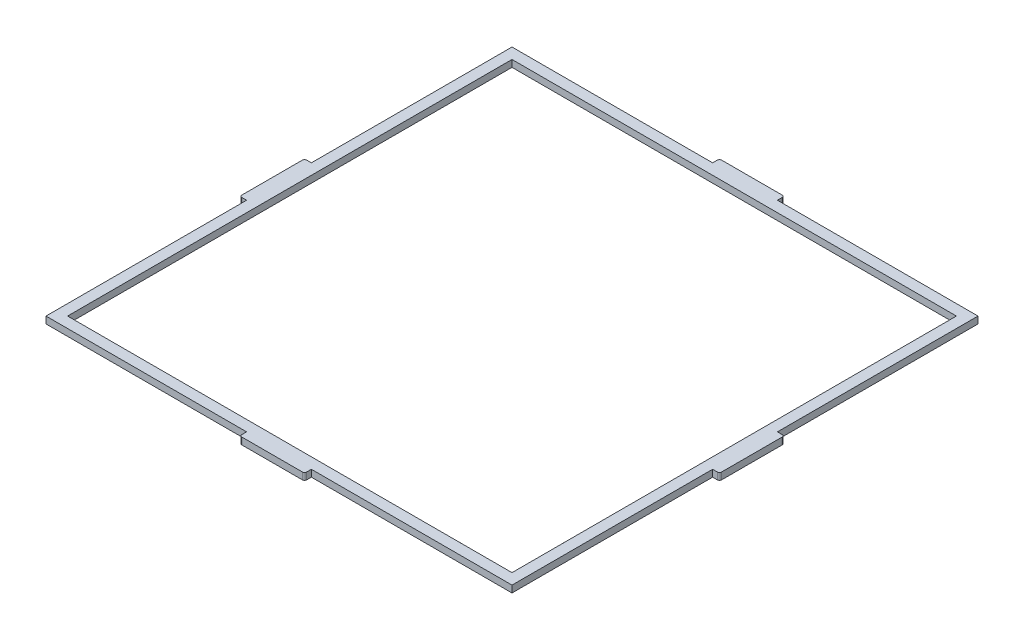
ISO-10303-21;
HEADER;
FILE_DESCRIPTION(('STEP AP214'),'2;1');
FILE_NAME('part.step','',(''),(''),'','','');
FILE_SCHEMA(('AUTOMOTIVE_DESIGN { 1 0 10303 214 1 1 1 1 }'));
ENDSEC;
DATA;
#1=APPLICATION_CONTEXT('core data for automotive mechanical design processes');
#2=APPLICATION_PROTOCOL_DEFINITION('international standard','automotive_design',2000,#1);
#3=PRODUCT_CONTEXT('',#1,'mechanical');
#4=PRODUCT('Part','Part','',(#3));
#5=PRODUCT_RELATED_PRODUCT_CATEGORY('part','',(#4));
#6=PRODUCT_DEFINITION_FORMATION('','',#4);
#7=PRODUCT_DEFINITION_CONTEXT('part definition',#1,'design');
#8=PRODUCT_DEFINITION('design','',#6,#7);
#9=PRODUCT_DEFINITION_SHAPE('','',#8);
#10=(LENGTH_UNIT() NAMED_UNIT(*) SI_UNIT(.MILLI.,.METRE.));
#11=(NAMED_UNIT(*) PLANE_ANGLE_UNIT() SI_UNIT($,.RADIAN.));
#12=(NAMED_UNIT(*) SI_UNIT($,.STERADIAN.) SOLID_ANGLE_UNIT());
#13=UNCERTAINTY_MEASURE_WITH_UNIT(LENGTH_MEASURE(1.E-05),#10,'distance_accuracy_value','');
#14=(GEOMETRIC_REPRESENTATION_CONTEXT(3) GLOBAL_UNCERTAINTY_ASSIGNED_CONTEXT((#13)) GLOBAL_UNIT_ASSIGNED_CONTEXT((#10,
#11,#12)) REPRESENTATION_CONTEXT('',''));
#15=CARTESIAN_POINT('',(0.,0.,0.));
#16=DIRECTION('',(0.,0.,1.));
#17=DIRECTION('',(1.,0.,0.));
#18=AXIS2_PLACEMENT_3D('',#15,#16,#17);
#19=CARTESIAN_POINT('',(107.955,3.175,107.955));
#20=DIRECTION('',(-1.,0.,0.));
#21=DIRECTION('',(0.,0.,1.));
#22=AXIS2_PLACEMENT_3D('',#19,#20,#21);
#23=PLANE('',#22);
#24=DIRECTION('',(0.,1.,0.));
#25=VECTOR('',#24,1.);
#26=CARTESIAN_POINT('',(107.955,0.,-15.));
#27=LINE('',#26,#25);
#28=CARTESIAN_POINT('',(107.955,0.,-15.));
#29=VERTEX_POINT('',#28);
#30=CARTESIAN_POINT('',(107.955,3.175,-15.));
#31=VERTEX_POINT('',#30);
#32=EDGE_CURVE('E271',#29,#31,#27,.T.);
#33=ORIENTED_EDGE('',*,*,#32,.F.);
#34=DIRECTION('',(0.,0.,-1.));
#35=VECTOR('',#34,1.);
#36=CARTESIAN_POINT('',(107.955,0.,107.955));
#37=LINE('',#36,#35);
#38=CARTESIAN_POINT('',(107.955,0.,-107.955));
#39=VERTEX_POINT('',#38);
#40=EDGE_CURVE('E316',#29,#39,#37,.T.);
#41=ORIENTED_EDGE('',*,*,#40,.T.);
#42=DIRECTION('',(0.,-1.,0.));
#43=VECTOR('',#42,1.);
#44=CARTESIAN_POINT('',(107.955,3.175,-107.955));
#45=LINE('',#44,#43);
#46=CARTESIAN_POINT('',(107.955,3.175,-107.955));
#47=VERTEX_POINT('',#46);
#48=EDGE_CURVE('E281',#47,#39,#45,.T.);
#49=ORIENTED_EDGE('',*,*,#48,.F.);
#50=DIRECTION('',(0.,0.,-1.));
#51=VECTOR('',#50,1.);
#52=CARTESIAN_POINT('',(107.955,3.175,107.955));
#53=LINE('',#52,#51);
#54=EDGE_CURVE('E260',#31,#47,#53,.T.);
#55=ORIENTED_EDGE('',*,*,#54,.F.);
#56=EDGE_LOOP('',(#33,#41,#49,#55));
#57=FACE_BOUND('',#56,.T.);
#58=ADVANCED_FACE('F44',(#57),#23,.F.);
#59=CARTESIAN_POINT('',(-107.955,3.175,-107.955));
#60=DIRECTION('',(0.,0.,1.));
#61=DIRECTION('',(1.,0.,0.));
#62=AXIS2_PLACEMENT_3D('',#59,#60,#61);
#63=PLANE('',#62);
#64=DIRECTION('',(0.,1.,0.));
#65=VECTOR('',#64,1.);
#66=CARTESIAN_POINT('',(-15.,0.,-107.955));
#67=LINE('',#66,#65);
#68=CARTESIAN_POINT('',(-15.,0.,-107.955));
#69=VERTEX_POINT('',#68);
#70=CARTESIAN_POINT('',(-15.,3.175,-107.955));
#71=VERTEX_POINT('',#70);
#72=EDGE_CURVE('E454',#69,#71,#67,.T.);
#73=ORIENTED_EDGE('',*,*,#72,.F.);
#74=DIRECTION('',(-1.,0.,0.));
#75=VECTOR('',#74,1.);
#76=CARTESIAN_POINT('',(-107.955,0.,-107.955));
#77=LINE('',#76,#75);
#78=CARTESIAN_POINT('',(-107.955,0.,-107.955));
#79=VERTEX_POINT('',#78);
#80=EDGE_CURVE('E315',#69,#79,#77,.T.);
#81=ORIENTED_EDGE('',*,*,#80,.T.);
#82=DIRECTION('',(0.,-1.,0.));
#83=VECTOR('',#82,1.);
#84=CARTESIAN_POINT('',(-107.955,3.175,-107.955));
#85=LINE('',#84,#83);
#86=CARTESIAN_POINT('',(-107.955,3.175,-107.955));
#87=VERTEX_POINT('',#86);
#88=EDGE_CURVE('E333',#87,#79,#85,.T.);
#89=ORIENTED_EDGE('',*,*,#88,.F.);
#90=DIRECTION('',(-1.,0.,0.));
#91=VECTOR('',#90,1.);
#92=CARTESIAN_POINT('',(-107.955,3.175,-107.955));
#93=LINE('',#92,#91);
#94=EDGE_CURVE('E289',#71,#87,#93,.T.);
#95=ORIENTED_EDGE('',*,*,#94,.F.);
#96=EDGE_LOOP('',(#73,#81,#89,#95));
#97=FACE_BOUND('',#96,.T.);
#98=ADVANCED_FACE('F605',(#97),#63,.F.);
#99=CARTESIAN_POINT('',(-107.955,3.175,107.955));
#100=DIRECTION('',(0.,0.,-1.));
#101=DIRECTION('',(-1.,0.,0.));
#102=AXIS2_PLACEMENT_3D('',#99,#100,#101);
#103=PLANE('',#102);
#104=DIRECTION('',(0.,1.,0.));
#105=VECTOR('',#104,1.);
#106=CARTESIAN_POINT('',(15.,0.,107.955));
#107=LINE('',#106,#105);
#108=CARTESIAN_POINT('',(15.,0.,107.955));
#109=VERTEX_POINT('',#108);
#110=CARTESIAN_POINT('',(15.,3.175,107.955));
#111=VERTEX_POINT('',#110);
#112=EDGE_CURVE('E478',#109,#111,#107,.T.);
#113=ORIENTED_EDGE('',*,*,#112,.F.);
#114=DIRECTION('',(1.,0.,0.));
#115=VECTOR('',#114,1.);
#116=CARTESIAN_POINT('',(-107.955,0.,107.955));
#117=LINE('',#116,#115);
#118=CARTESIAN_POINT('',(107.955,0.,107.955));
#119=VERTEX_POINT('',#118);
#120=EDGE_CURVE('E291',#109,#119,#117,.T.);
#121=ORIENTED_EDGE('',*,*,#120,.T.);
#122=DIRECTION('',(0.,-1.,0.));
#123=VECTOR('',#122,1.);
#124=CARTESIAN_POINT('',(107.955,3.175,107.955));
#125=LINE('',#124,#123);
#126=CARTESIAN_POINT('',(107.955,3.175,107.955));
#127=VERTEX_POINT('',#126);
#128=EDGE_CURVE('E310',#127,#119,#125,.T.);
#129=ORIENTED_EDGE('',*,*,#128,.F.);
#130=DIRECTION('',(1.,0.,0.));
#131=VECTOR('',#130,1.);
#132=CARTESIAN_POINT('',(-107.955,3.175,107.955));
#133=LINE('',#132,#131);
#134=EDGE_CURVE('E305',#111,#127,#133,.T.);
#135=ORIENTED_EDGE('',*,*,#134,.F.);
#136=EDGE_LOOP('',(#113,#121,#129,#135));
#137=FACE_BOUND('',#136,.T.);
#138=ADVANCED_FACE('F612',(#137),#103,.F.);
#139=CARTESIAN_POINT('',(-107.955,3.175,107.955));
#140=DIRECTION('',(1.,0.,0.));
#141=DIRECTION('',(0.,0.,-1.));
#142=AXIS2_PLACEMENT_3D('',#139,#140,#141);
#143=PLANE('',#142);
#144=DIRECTION('',(0.,1.,0.));
#145=VECTOR('',#144,1.);
#146=CARTESIAN_POINT('',(-107.955,0.,15.));
#147=LINE('',#146,#145);
#148=CARTESIAN_POINT('',(-107.955,0.,15.));
#149=VERTEX_POINT('',#148);
#150=CARTESIAN_POINT('',(-107.955,3.175,15.));
#151=VERTEX_POINT('',#150);
#152=EDGE_CURVE('E520',#149,#151,#147,.T.);
#153=ORIENTED_EDGE('',*,*,#152,.F.);
#154=DIRECTION('',(0.,0.,1.));
#155=VECTOR('',#154,1.);
#156=CARTESIAN_POINT('',(-107.955,0.,107.955));
#157=LINE('',#156,#155);
#158=CARTESIAN_POINT('',(-107.955,0.,107.955));
#159=VERTEX_POINT('',#158);
#160=EDGE_CURVE('E321',#149,#159,#157,.T.);
#161=ORIENTED_EDGE('',*,*,#160,.T.);
#162=DIRECTION('',(0.,-1.,0.));
#163=VECTOR('',#162,1.);
#164=CARTESIAN_POINT('',(-107.955,3.175,107.955));
#165=LINE('',#164,#163);
#166=CARTESIAN_POINT('',(-107.955,3.175,107.955));
#167=VERTEX_POINT('',#166);
#168=EDGE_CURVE('E329',#167,#159,#165,.T.);
#169=ORIENTED_EDGE('',*,*,#168,.F.);
#170=DIRECTION('',(0.,0.,1.));
#171=VECTOR('',#170,1.);
#172=CARTESIAN_POINT('',(-107.955,3.175,107.955));
#173=LINE('',#172,#171);
#174=EDGE_CURVE('E300',#151,#167,#173,.T.);
#175=ORIENTED_EDGE('',*,*,#174,.F.);
#176=EDGE_LOOP('',(#153,#161,#169,#175));
#177=FACE_BOUND('',#176,.T.);
#178=ADVANCED_FACE('F618',(#177),#143,.F.);
#179=CARTESIAN_POINT('',(107.955,0.,14.9999999999999));
#180=VERTEX_POINT('',#179);
#181=EDGE_CURVE('E311',#119,#180,#37,.T.);
#182=ORIENTED_EDGE('',*,*,#181,.T.);
#183=DIRECTION('',(0.,1.,0.));
#184=VECTOR('',#183,1.);
#185=CARTESIAN_POINT('',(107.955,0.,14.9999999999999));
#186=LINE('',#185,#184);
#187=CARTESIAN_POINT('',(107.955,3.175,14.9999999999999));
#188=VERTEX_POINT('',#187);
#189=EDGE_CURVE('E277',#180,#188,#186,.T.);
#190=ORIENTED_EDGE('',*,*,#189,.T.);
#191=EDGE_CURVE('E283',#127,#188,#53,.T.);
#192=ORIENTED_EDGE('',*,*,#191,.F.);
#193=ORIENTED_EDGE('',*,*,#128,.T.);
#194=EDGE_LOOP('',(#182,#190,#192,#193));
#195=FACE_BOUND('',#194,.T.);
#196=ADVANCED_FACE('F607',(#195),#23,.F.);
#197=CARTESIAN_POINT('',(15.,0.,-107.955));
#198=VERTEX_POINT('',#197);
#199=EDGE_CURVE('E317',#39,#198,#77,.T.);
#200=ORIENTED_EDGE('',*,*,#199,.T.);
#201=DIRECTION('',(0.,1.,0.));
#202=VECTOR('',#201,1.);
#203=CARTESIAN_POINT('',(15.,0.,-107.955));
#204=LINE('',#203,#202);
#205=CARTESIAN_POINT('',(15.,3.175,-107.955));
#206=VERTEX_POINT('',#205);
#207=EDGE_CURVE('E645',#198,#206,#204,.T.);
#208=ORIENTED_EDGE('',*,*,#207,.T.);
#209=EDGE_CURVE('E297',#47,#206,#93,.T.);
#210=ORIENTED_EDGE('',*,*,#209,.F.);
#211=ORIENTED_EDGE('',*,*,#48,.T.);
#212=EDGE_LOOP('',(#200,#208,#210,#211));
#213=FACE_BOUND('',#212,.T.);
#214=ADVANCED_FACE('F615',(#213),#63,.F.);
#215=CARTESIAN_POINT('',(-107.955,0.,-15.));
#216=VERTEX_POINT('',#215);
#217=EDGE_CURVE('E322',#79,#216,#157,.T.);
#218=ORIENTED_EDGE('',*,*,#217,.T.);
#219=DIRECTION('',(0.,1.,0.));
#220=VECTOR('',#219,1.);
#221=CARTESIAN_POINT('',(-107.955,0.,-15.));
#222=LINE('',#221,#220);
#223=CARTESIAN_POINT('',(-107.955,3.175,-15.));
#224=VERTEX_POINT('',#223);
#225=EDGE_CURVE('E529',#216,#224,#222,.T.);
#226=ORIENTED_EDGE('',*,*,#225,.T.);
#227=EDGE_CURVE('E301',#87,#224,#173,.T.);
#228=ORIENTED_EDGE('',*,*,#227,.F.);
#229=ORIENTED_EDGE('',*,*,#88,.T.);
#230=EDGE_LOOP('',(#218,#226,#228,#229));
#231=FACE_BOUND('',#230,.T.);
#232=ADVANCED_FACE('F624',(#231),#143,.F.);
#233=CARTESIAN_POINT('',(-15.,0.,107.955));
#234=VERTEX_POINT('',#233);
#235=EDGE_CURVE('E284',#159,#234,#117,.T.);
#236=ORIENTED_EDGE('',*,*,#235,.T.);
#237=DIRECTION('',(0.,1.,0.));
#238=VECTOR('',#237,1.);
#239=CARTESIAN_POINT('',(-15.,0.,107.955));
#240=LINE('',#239,#238);
#241=CARTESIAN_POINT('',(-15.,3.175,107.955));
#242=VERTEX_POINT('',#241);
#243=EDGE_CURVE('E468',#234,#242,#240,.T.);
#244=ORIENTED_EDGE('',*,*,#243,.T.);
#245=EDGE_CURVE('E306',#167,#242,#133,.T.);
#246=ORIENTED_EDGE('',*,*,#245,.F.);
#247=ORIENTED_EDGE('',*,*,#168,.T.);
#248=EDGE_LOOP('',(#236,#244,#246,#247));
#249=FACE_BOUND('',#248,.T.);
#250=ADVANCED_FACE('F745',(#249),#103,.F.);
#251=CARTESIAN_POINT('',(0.,3.175,0.));
#252=DIRECTION('',(0.,-1.,0.));
#253=DIRECTION('',(0.,0.,-1.));
#254=AXIS2_PLACEMENT_3D('',#251,#252,#253);
#255=PLANE('',#254);
#256=DIRECTION('',(-1.,0.,0.));
#257=VECTOR('',#256,1.);
#258=CARTESIAN_POINT('',(-102.955,3.175,-102.955));
#259=LINE('',#258,#257);
#260=CARTESIAN_POINT('',(102.955,3.175,-102.955));
#261=VERTEX_POINT('',#260);
#262=CARTESIAN_POINT('',(-102.955,3.175,-102.955));
#263=VERTEX_POINT('',#262);
#264=EDGE_CURVE('E556',#261,#263,#259,.T.);
#265=ORIENTED_EDGE('',*,*,#264,.F.);
#266=DIRECTION('',(0.,0.,-1.));
#267=VECTOR('',#266,1.);
#268=CARTESIAN_POINT('',(102.955,3.175,102.955));
#269=LINE('',#268,#267);
#270=CARTESIAN_POINT('',(102.955,3.175,102.955));
#271=VERTEX_POINT('',#270);
#272=EDGE_CURVE('E533',#271,#261,#269,.T.);
#273=ORIENTED_EDGE('',*,*,#272,.F.);
#274=DIRECTION('',(1.,0.,0.));
#275=VECTOR('',#274,1.);
#276=CARTESIAN_POINT('',(-102.955,3.175,102.955));
#277=LINE('',#276,#275);
#278=CARTESIAN_POINT('',(-102.955,3.175,102.955));
#279=VERTEX_POINT('',#278);
#280=EDGE_CURVE('E542',#279,#271,#277,.T.);
#281=ORIENTED_EDGE('',*,*,#280,.F.);
#282=DIRECTION('',(0.,0.,1.));
#283=VECTOR('',#282,1.);
#284=CARTESIAN_POINT('',(-102.955,3.175,102.955));
#285=LINE('',#284,#283);
#286=EDGE_CURVE('E560',#263,#279,#285,.T.);
#287=ORIENTED_EDGE('',*,*,#286,.F.);
#288=EDGE_LOOP('',(#265,#273,#281,#287));
#289=FACE_BOUND('',#288,.T.);
#290=DIRECTION('',(0.,0.,1.));
#291=VECTOR('',#290,1.);
#292=CARTESIAN_POINT('',(-111.13,3.175,15.));
#293=LINE('',#292,#291);
#294=CARTESIAN_POINT('',(-111.13,3.175,-14.));
#295=VERTEX_POINT('',#294);
#296=CARTESIAN_POINT('',(-111.13,3.175,14.));
#297=VERTEX_POINT('',#296);
#298=EDGE_CURVE('E498',#295,#297,#293,.T.);
#299=ORIENTED_EDGE('',*,*,#298,.T.);
#300=CARTESIAN_POINT('',(-110.13,3.175,14.));
#301=DIRECTION('',(0.,-1.,0.));
#302=DIRECTION('',(0.,0.,-1.));
#303=AXIS2_PLACEMENT_3D('',#300,#301,#302);
#304=CIRCLE('',#303,1.);
#305=CARTESIAN_POINT('',(-110.13,3.175,15.));
#306=VERTEX_POINT('',#305);
#307=EDGE_CURVE('E366',#297,#306,#304,.F.);
#308=ORIENTED_EDGE('',*,*,#307,.T.);
#309=DIRECTION('',(1.,0.,0.));
#310=VECTOR('',#309,1.);
#311=CARTESIAN_POINT('',(-107.955,3.175,15.));
#312=LINE('',#311,#310);
#313=EDGE_CURVE('E523',#306,#151,#312,.T.);
#314=ORIENTED_EDGE('',*,*,#313,.T.);
#315=ORIENTED_EDGE('',*,*,#174,.T.);
#316=ORIENTED_EDGE('',*,*,#245,.T.);
#317=DIRECTION('',(0.,0.,1.));
#318=VECTOR('',#317,1.);
#319=CARTESIAN_POINT('',(-15.,3.175,107.955));
#320=LINE('',#319,#318);
#321=CARTESIAN_POINT('',(-15.,3.175,110.13));
#322=VERTEX_POINT('',#321);
#323=EDGE_CURVE('E494',#242,#322,#320,.T.);
#324=ORIENTED_EDGE('',*,*,#323,.T.);
#325=CARTESIAN_POINT('',(-14.,3.175,110.13));
#326=DIRECTION('',(0.,-1.,0.));
#327=DIRECTION('',(0.,0.,-1.));
#328=AXIS2_PLACEMENT_3D('',#325,#326,#327);
#329=CIRCLE('',#328,1.);
#330=CARTESIAN_POINT('',(-14.,3.175,111.13));
#331=VERTEX_POINT('',#330);
#332=EDGE_CURVE('E357',#322,#331,#329,.F.);
#333=ORIENTED_EDGE('',*,*,#332,.T.);
#334=DIRECTION('',(1.,0.,0.));
#335=VECTOR('',#334,1.);
#336=CARTESIAN_POINT('',(-15.,3.175,111.13));
#337=LINE('',#336,#335);
#338=CARTESIAN_POINT('',(14.,3.175,111.13));
#339=VERTEX_POINT('',#338);
#340=EDGE_CURVE('E489',#331,#339,#337,.T.);
#341=ORIENTED_EDGE('',*,*,#340,.T.);
#342=CARTESIAN_POINT('',(14.,3.175,110.13));
#343=DIRECTION('',(0.,-1.,0.));
#344=DIRECTION('',(0.,0.,-1.));
#345=AXIS2_PLACEMENT_3D('',#342,#343,#344);
#346=CIRCLE('',#345,1.);
#347=CARTESIAN_POINT('',(15.,3.175,110.13));
#348=VERTEX_POINT('',#347);
#349=EDGE_CURVE('E360',#339,#348,#346,.F.);
#350=ORIENTED_EDGE('',*,*,#349,.T.);
#351=DIRECTION('',(0.,0.,-1.));
#352=VECTOR('',#351,1.);
#353=CARTESIAN_POINT('',(15.,3.175,107.955));
#354=LINE('',#353,#352);
#355=EDGE_CURVE('E486',#348,#111,#354,.T.);
#356=ORIENTED_EDGE('',*,*,#355,.T.);
#357=ORIENTED_EDGE('',*,*,#134,.T.);
#358=ORIENTED_EDGE('',*,*,#191,.T.);
#359=DIRECTION('',(1.,0.,0.));
#360=VECTOR('',#359,1.);
#361=CARTESIAN_POINT('',(107.955,3.175,14.9999999999999));
#362=LINE('',#361,#360);
#363=CARTESIAN_POINT('',(110.13,3.175,14.9999999999999));
#364=VERTEX_POINT('',#363);
#365=EDGE_CURVE('E647',#188,#364,#362,.T.);
#366=ORIENTED_EDGE('',*,*,#365,.T.);
#367=CARTESIAN_POINT('',(110.13,3.175,13.9999999999999));
#368=DIRECTION('',(0.,-1.,0.));
#369=DIRECTION('',(0.,0.,-1.));
#370=AXIS2_PLACEMENT_3D('',#367,#368,#369);
#371=CIRCLE('',#370,1.);
#372=CARTESIAN_POINT('',(111.13,3.175,13.9999999999999));
#373=VERTEX_POINT('',#372);
#374=EDGE_CURVE('E354',#364,#373,#371,.F.);
#375=ORIENTED_EDGE('',*,*,#374,.T.);
#376=DIRECTION('',(0.,0.,-1.));
#377=VECTOR('',#376,1.);
#378=CARTESIAN_POINT('',(111.13,3.175,14.9999999999999));
#379=LINE('',#378,#377);
#380=CARTESIAN_POINT('',(111.13,3.175,-14.));
#381=VERTEX_POINT('',#380);
#382=EDGE_CURVE('E267',#373,#381,#379,.T.);
#383=ORIENTED_EDGE('',*,*,#382,.T.);
#384=CARTESIAN_POINT('',(110.13,3.175,-14.));
#385=DIRECTION('',(0.,-1.,0.));
#386=DIRECTION('',(0.,0.,-1.));
#387=AXIS2_PLACEMENT_3D('',#384,#385,#386);
#388=CIRCLE('',#387,1.);
#389=CARTESIAN_POINT('',(110.13,3.175,-15.));
#390=VERTEX_POINT('',#389);
#391=EDGE_CURVE('E263',#381,#390,#388,.F.);
#392=ORIENTED_EDGE('',*,*,#391,.T.);
#393=DIRECTION('',(-1.,0.,0.));
#394=VECTOR('',#393,1.);
#395=CARTESIAN_POINT('',(107.955,3.175,-15.));
#396=LINE('',#395,#394);
#397=EDGE_CURVE('E254',#390,#31,#396,.T.);
#398=ORIENTED_EDGE('',*,*,#397,.T.);
#399=ORIENTED_EDGE('',*,*,#54,.T.);
#400=ORIENTED_EDGE('',*,*,#209,.T.);
#401=DIRECTION('',(0.,0.,-1.));
#402=VECTOR('',#401,1.);
#403=CARTESIAN_POINT('',(15.,3.175,-107.955));
#404=LINE('',#403,#402);
#405=CARTESIAN_POINT('',(15.,3.175,-110.13));
#406=VERTEX_POINT('',#405);
#407=EDGE_CURVE('E461',#206,#406,#404,.T.);
#408=ORIENTED_EDGE('',*,*,#407,.T.);
#409=CARTESIAN_POINT('',(14.,3.175,-110.13));
#410=DIRECTION('',(0.,-1.,0.));
#411=DIRECTION('',(0.,0.,-1.));
#412=AXIS2_PLACEMENT_3D('',#409,#410,#411);
#413=CIRCLE('',#412,1.);
#414=CARTESIAN_POINT('',(14.,3.175,-111.13));
#415=VERTEX_POINT('',#414);
#416=EDGE_CURVE('E349',#406,#415,#413,.F.);
#417=ORIENTED_EDGE('',*,*,#416,.T.);
#418=DIRECTION('',(-1.,0.,0.));
#419=VECTOR('',#418,1.);
#420=CARTESIAN_POINT('',(-15.,3.175,-111.13));
#421=LINE('',#420,#419);
#422=CARTESIAN_POINT('',(-14.,3.175,-111.13));
#423=VERTEX_POINT('',#422);
#424=EDGE_CURVE('E443',#415,#423,#421,.T.);
#425=ORIENTED_EDGE('',*,*,#424,.T.);
#426=CARTESIAN_POINT('',(-14.,3.175,-110.13));
#427=DIRECTION('',(0.,-1.,0.));
#428=DIRECTION('',(0.,0.,-1.));
#429=AXIS2_PLACEMENT_3D('',#426,#427,#428);
#430=CIRCLE('',#429,1.);
#431=CARTESIAN_POINT('',(-15.,3.175,-110.13));
#432=VERTEX_POINT('',#431);
#433=EDGE_CURVE('E346',#423,#432,#430,.F.);
#434=ORIENTED_EDGE('',*,*,#433,.T.);
#435=DIRECTION('',(0.,0.,1.));
#436=VECTOR('',#435,1.);
#437=CARTESIAN_POINT('',(-15.,3.175,-107.955));
#438=LINE('',#437,#436);
#439=EDGE_CURVE('E464',#432,#71,#438,.T.);
#440=ORIENTED_EDGE('',*,*,#439,.T.);
#441=ORIENTED_EDGE('',*,*,#94,.T.);
#442=ORIENTED_EDGE('',*,*,#227,.T.);
#443=DIRECTION('',(-1.,0.,0.));
#444=VECTOR('',#443,1.);
#445=CARTESIAN_POINT('',(-107.955,3.175,-15.));
#446=LINE('',#445,#444);
#447=CARTESIAN_POINT('',(-110.13,3.175,-15.));
#448=VERTEX_POINT('',#447);
#449=EDGE_CURVE('E513',#224,#448,#446,.T.);
#450=ORIENTED_EDGE('',*,*,#449,.T.);
#451=CARTESIAN_POINT('',(-110.13,3.175,-14.));
#452=DIRECTION('',(0.,-1.,0.));
#453=DIRECTION('',(0.,0.,-1.));
#454=AXIS2_PLACEMENT_3D('',#451,#452,#453);
#455=CIRCLE('',#454,1.);
#456=EDGE_CURVE('E363',#448,#295,#455,.F.);
#457=ORIENTED_EDGE('',*,*,#456,.T.);
#458=EDGE_LOOP('',(#299,#308,#314,#315,#316,#324,#333,#341,#350,#356,#357,#358,#366,#375,#383,
#392,#398,#399,#400,#408,#417,#425,#434,#440,#441,#442,#450,#457));
#459=FACE_BOUND('',#458,.T.);
#460=ADVANCED_FACE('F257',(#289,#459),#255,.F.);
#461=CARTESIAN_POINT('',(0.,0.,0.));
#462=DIRECTION('',(0.,-1.,0.));
#463=DIRECTION('',(0.,0.,-1.));
#464=AXIS2_PLACEMENT_3D('',#461,#462,#463);
#465=PLANE('',#464);
#466=DIRECTION('',(0.,0.,-1.));
#467=VECTOR('',#466,1.);
#468=CARTESIAN_POINT('',(102.955,0.,102.955));
#469=LINE('',#468,#467);
#470=CARTESIAN_POINT('',(102.955,0.,102.955));
#471=VERTEX_POINT('',#470);
#472=CARTESIAN_POINT('',(102.955,0.,-102.955));
#473=VERTEX_POINT('',#472);
#474=EDGE_CURVE('E537',#471,#473,#469,.T.);
#475=ORIENTED_EDGE('',*,*,#474,.T.);
#476=DIRECTION('',(-1.,0.,0.));
#477=VECTOR('',#476,1.);
#478=CARTESIAN_POINT('',(-102.955,0.,-102.955));
#479=LINE('',#478,#477);
#480=CARTESIAN_POINT('',(-102.955,0.,-102.955));
#481=VERTEX_POINT('',#480);
#482=EDGE_CURVE('E541',#473,#481,#479,.T.);
#483=ORIENTED_EDGE('',*,*,#482,.T.);
#484=DIRECTION('',(0.,0.,1.));
#485=VECTOR('',#484,1.);
#486=CARTESIAN_POINT('',(-102.955,0.,102.955));
#487=LINE('',#486,#485);
#488=CARTESIAN_POINT('',(-102.955,0.,102.955));
#489=VERTEX_POINT('',#488);
#490=EDGE_CURVE('E546',#481,#489,#487,.T.);
#491=ORIENTED_EDGE('',*,*,#490,.T.);
#492=DIRECTION('',(1.,0.,0.));
#493=VECTOR('',#492,1.);
#494=CARTESIAN_POINT('',(-102.955,0.,102.955));
#495=LINE('',#494,#493);
#496=EDGE_CURVE('E550',#489,#471,#495,.T.);
#497=ORIENTED_EDGE('',*,*,#496,.T.);
#498=EDGE_LOOP('',(#475,#483,#491,#497));
#499=FACE_BOUND('',#498,.T.);
#500=DIRECTION('',(1.,0.,0.));
#501=VECTOR('',#500,1.);
#502=CARTESIAN_POINT('',(-107.955,0.,15.));
#503=LINE('',#502,#501);
#504=CARTESIAN_POINT('',(-110.13,0.,15.));
#505=VERTEX_POINT('',#504);
#506=EDGE_CURVE('E512',#505,#149,#503,.T.);
#507=ORIENTED_EDGE('',*,*,#506,.F.);
#508=CARTESIAN_POINT('',(-110.13,0.,14.));
#509=DIRECTION('',(0.,-1.,0.));
#510=DIRECTION('',(0.,0.,-1.));
#511=AXIS2_PLACEMENT_3D('',#508,#509,#510);
#512=CIRCLE('',#511,1.);
#513=CARTESIAN_POINT('',(-111.13,0.,14.));
#514=VERTEX_POINT('',#513);
#515=EDGE_CURVE('E391',#505,#514,#512,.T.);
#516=ORIENTED_EDGE('',*,*,#515,.T.);
#517=DIRECTION('',(0.,0.,1.));
#518=VECTOR('',#517,1.);
#519=CARTESIAN_POINT('',(-111.13,0.,15.));
#520=LINE('',#519,#518);
#521=CARTESIAN_POINT('',(-111.13,0.,-14.));
#522=VERTEX_POINT('',#521);
#523=EDGE_CURVE('E508',#522,#514,#520,.T.);
#524=ORIENTED_EDGE('',*,*,#523,.F.);
#525=CARTESIAN_POINT('',(-110.13,0.,-14.));
#526=DIRECTION('',(0.,-1.,0.));
#527=DIRECTION('',(0.,0.,-1.));
#528=AXIS2_PLACEMENT_3D('',#525,#526,#527);
#529=CIRCLE('',#528,1.);
#530=CARTESIAN_POINT('',(-110.13,0.,-15.));
#531=VERTEX_POINT('',#530);
#532=EDGE_CURVE('E388',#522,#531,#529,.T.);
#533=ORIENTED_EDGE('',*,*,#532,.T.);
#534=DIRECTION('',(-1.,0.,0.));
#535=VECTOR('',#534,1.);
#536=CARTESIAN_POINT('',(-107.955,0.,-15.));
#537=LINE('',#536,#535);
#538=EDGE_CURVE('E516',#216,#531,#537,.T.);
#539=ORIENTED_EDGE('',*,*,#538,.F.);
#540=ORIENTED_EDGE('',*,*,#217,.F.);
#541=ORIENTED_EDGE('',*,*,#80,.F.);
#542=DIRECTION('',(0.,0.,1.));
#543=VECTOR('',#542,1.);
#544=CARTESIAN_POINT('',(-15.,0.,-107.955));
#545=LINE('',#544,#543);
#546=CARTESIAN_POINT('',(-15.,0.,-110.13));
#547=VERTEX_POINT('',#546);
#548=EDGE_CURVE('E470',#547,#69,#545,.T.);
#549=ORIENTED_EDGE('',*,*,#548,.F.);
#550=CARTESIAN_POINT('',(-14.,0.,-110.13));
#551=DIRECTION('',(0.,-1.,0.));
#552=DIRECTION('',(0.,0.,-1.));
#553=AXIS2_PLACEMENT_3D('',#550,#551,#552);
#554=CIRCLE('',#553,1.);
#555=CARTESIAN_POINT('',(-14.,0.,-111.13));
#556=VERTEX_POINT('',#555);
#557=EDGE_CURVE('E372',#547,#556,#554,.T.);
#558=ORIENTED_EDGE('',*,*,#557,.T.);
#559=DIRECTION('',(-1.,0.,0.));
#560=VECTOR('',#559,1.);
#561=CARTESIAN_POINT('',(-15.,0.,-111.13));
#562=LINE('',#561,#560);
#563=CARTESIAN_POINT('',(14.,0.,-111.13));
#564=VERTEX_POINT('',#563);
#565=EDGE_CURVE('E440',#564,#556,#562,.T.);
#566=ORIENTED_EDGE('',*,*,#565,.F.);
#567=CARTESIAN_POINT('',(14.,0.,-110.13));
#568=DIRECTION('',(0.,-1.,0.));
#569=DIRECTION('',(0.,0.,-1.));
#570=AXIS2_PLACEMENT_3D('',#567,#568,#569);
#571=CIRCLE('',#570,1.);
#572=CARTESIAN_POINT('',(15.,0.,-110.13));
#573=VERTEX_POINT('',#572);
#574=EDGE_CURVE('E375',#564,#573,#571,.T.);
#575=ORIENTED_EDGE('',*,*,#574,.T.);
#576=DIRECTION('',(0.,0.,-1.));
#577=VECTOR('',#576,1.);
#578=CARTESIAN_POINT('',(15.,0.,-107.955));
#579=LINE('',#578,#577);
#580=EDGE_CURVE('E453',#198,#573,#579,.T.);
#581=ORIENTED_EDGE('',*,*,#580,.F.);
#582=ORIENTED_EDGE('',*,*,#199,.F.);
#583=ORIENTED_EDGE('',*,*,#40,.F.);
#584=DIRECTION('',(-1.,0.,0.));
#585=VECTOR('',#584,1.);
#586=CARTESIAN_POINT('',(107.955,0.,-15.));
#587=LINE('',#586,#585);
#588=CARTESIAN_POINT('',(110.13,0.,-15.));
#589=VERTEX_POINT('',#588);
#590=EDGE_CURVE('E273',#589,#29,#587,.T.);
#591=ORIENTED_EDGE('',*,*,#590,.F.);
#592=CARTESIAN_POINT('',(110.13,0.,-14.));
#593=DIRECTION('',(0.,-1.,0.));
#594=DIRECTION('',(0.,0.,-1.));
#595=AXIS2_PLACEMENT_3D('',#592,#593,#594);
#596=CIRCLE('',#595,1.);
#597=CARTESIAN_POINT('',(111.13,0.,-14.));
#598=VERTEX_POINT('',#597);
#599=EDGE_CURVE('E66',#589,#598,#596,.T.);
#600=ORIENTED_EDGE('',*,*,#599,.T.);
#601=DIRECTION('',(0.,0.,-1.));
#602=VECTOR('',#601,1.);
#603=CARTESIAN_POINT('',(111.13,0.,14.9999999999999));
#604=LINE('',#603,#602);
#605=CARTESIAN_POINT('',(111.13,0.,13.9999999999999));
#606=VERTEX_POINT('',#605);
#607=EDGE_CURVE('E637',#606,#598,#604,.T.);
#608=ORIENTED_EDGE('',*,*,#607,.F.);
#609=CARTESIAN_POINT('',(110.13,0.,13.9999999999999));
#610=DIRECTION('',(0.,-1.,0.));
#611=DIRECTION('',(0.,0.,-1.));
#612=AXIS2_PLACEMENT_3D('',#609,#610,#611);
#613=CIRCLE('',#612,1.);
#614=CARTESIAN_POINT('',(110.13,0.,14.9999999999999));
#615=VERTEX_POINT('',#614);
#616=EDGE_CURVE('E60',#606,#615,#613,.T.);
#617=ORIENTED_EDGE('',*,*,#616,.T.);
#618=DIRECTION('',(1.,0.,0.));
#619=VECTOR('',#618,1.);
#620=CARTESIAN_POINT('',(107.955,0.,14.9999999999999));
#621=LINE('',#620,#619);
#622=EDGE_CURVE('E268',#180,#615,#621,.T.);
#623=ORIENTED_EDGE('',*,*,#622,.F.);
#624=ORIENTED_EDGE('',*,*,#181,.F.);
#625=ORIENTED_EDGE('',*,*,#120,.F.);
#626=DIRECTION('',(0.,0.,-1.));
#627=VECTOR('',#626,1.);
#628=CARTESIAN_POINT('',(15.,0.,107.955));
#629=LINE('',#628,#627);
#630=CARTESIAN_POINT('',(15.,0.,110.13));
#631=VERTEX_POINT('',#630);
#632=EDGE_CURVE('E482',#631,#109,#629,.T.);
#633=ORIENTED_EDGE('',*,*,#632,.F.);
#634=CARTESIAN_POINT('',(14.,0.,110.13));
#635=DIRECTION('',(0.,-1.,0.));
#636=DIRECTION('',(0.,0.,-1.));
#637=AXIS2_PLACEMENT_3D('',#634,#635,#636);
#638=CIRCLE('',#637,1.);
#639=CARTESIAN_POINT('',(14.,0.,111.13));
#640=VERTEX_POINT('',#639);
#641=EDGE_CURVE('E385',#631,#640,#638,.T.);
#642=ORIENTED_EDGE('',*,*,#641,.T.);
#643=DIRECTION('',(1.,0.,0.));
#644=VECTOR('',#643,1.);
#645=CARTESIAN_POINT('',(-15.,0.,111.13));
#646=LINE('',#645,#644);
#647=CARTESIAN_POINT('',(-14.,0.,111.13));
#648=VERTEX_POINT('',#647);
#649=EDGE_CURVE('E501',#648,#640,#646,.T.);
#650=ORIENTED_EDGE('',*,*,#649,.F.);
#651=CARTESIAN_POINT('',(-14.,0.,110.13));
#652=DIRECTION('',(0.,-1.,0.));
#653=DIRECTION('',(0.,0.,-1.));
#654=AXIS2_PLACEMENT_3D('',#651,#652,#653);
#655=CIRCLE('',#654,1.);
#656=CARTESIAN_POINT('',(-15.,0.,110.13));
#657=VERTEX_POINT('',#656);
#658=EDGE_CURVE('E382',#648,#657,#655,.T.);
#659=ORIENTED_EDGE('',*,*,#658,.T.);
#660=DIRECTION('',(0.,0.,1.));
#661=VECTOR('',#660,1.);
#662=CARTESIAN_POINT('',(-15.,0.,107.955));
#663=LINE('',#662,#661);
#664=EDGE_CURVE('E490',#234,#657,#663,.T.);
#665=ORIENTED_EDGE('',*,*,#664,.F.);
#666=ORIENTED_EDGE('',*,*,#235,.F.);
#667=ORIENTED_EDGE('',*,*,#160,.F.);
#668=EDGE_LOOP('',(#507,#516,#524,#533,#539,#540,#541,#549,#558,#566,#575,#581,#582,#583,#591,
#600,#608,#617,#623,#624,#625,#633,#642,#650,#659,#665,#666,#667));
#669=FACE_BOUND('',#668,.T.);
#670=ADVANCED_FACE('F447',(#499,#669),#465,.T.);
#671=CARTESIAN_POINT('',(102.955,0.,102.955));
#672=DIRECTION('',(1.,0.,0.));
#673=DIRECTION('',(0.,0.,-1.));
#674=AXIS2_PLACEMENT_3D('',#671,#672,#673);
#675=PLANE('',#674);
#676=ORIENTED_EDGE('',*,*,#272,.T.);
#677=DIRECTION('',(0.,1.,0.));
#678=VECTOR('',#677,1.);
#679=CARTESIAN_POINT('',(102.955,0.,-102.955));
#680=LINE('',#679,#678);
#681=EDGE_CURVE('E295',#473,#261,#680,.T.);
#682=ORIENTED_EDGE('',*,*,#681,.F.);
#683=ORIENTED_EDGE('',*,*,#474,.F.);
#684=DIRECTION('',(0.,1.,0.));
#685=VECTOR('',#684,1.);
#686=CARTESIAN_POINT('',(102.955,0.,102.955));
#687=LINE('',#686,#685);
#688=EDGE_CURVE('E567',#471,#271,#687,.T.);
#689=ORIENTED_EDGE('',*,*,#688,.T.);
#690=EDGE_LOOP('',(#676,#682,#683,#689));
#691=FACE_BOUND('',#690,.T.);
#692=ADVANCED_FACE('F593',(#691),#675,.F.);
#693=CARTESIAN_POINT('',(-102.955,0.,102.955));
#694=DIRECTION('',(0.,0.,1.));
#695=DIRECTION('',(1.,0.,0.));
#696=AXIS2_PLACEMENT_3D('',#693,#694,#695);
#697=PLANE('',#696);
#698=ORIENTED_EDGE('',*,*,#280,.T.);
#699=ORIENTED_EDGE('',*,*,#688,.F.);
#700=ORIENTED_EDGE('',*,*,#496,.F.);
#701=DIRECTION('',(0.,1.,0.));
#702=VECTOR('',#701,1.);
#703=CARTESIAN_POINT('',(-102.955,0.,102.955));
#704=LINE('',#703,#702);
#705=EDGE_CURVE('E570',#489,#279,#704,.T.);
#706=ORIENTED_EDGE('',*,*,#705,.T.);
#707=EDGE_LOOP('',(#698,#699,#700,#706));
#708=FACE_BOUND('',#707,.T.);
#709=ADVANCED_FACE('F591',(#708),#697,.F.);
#710=CARTESIAN_POINT('',(-102.955,0.,102.955));
#711=DIRECTION('',(-1.,0.,0.));
#712=DIRECTION('',(0.,0.,1.));
#713=AXIS2_PLACEMENT_3D('',#710,#711,#712);
#714=PLANE('',#713);
#715=ORIENTED_EDGE('',*,*,#286,.T.);
#716=ORIENTED_EDGE('',*,*,#705,.F.);
#717=ORIENTED_EDGE('',*,*,#490,.F.);
#718=DIRECTION('',(0.,1.,0.));
#719=VECTOR('',#718,1.);
#720=CARTESIAN_POINT('',(-102.955,0.,-102.955));
#721=LINE('',#720,#719);
#722=EDGE_CURVE('E572',#481,#263,#721,.T.);
#723=ORIENTED_EDGE('',*,*,#722,.T.);
#724=EDGE_LOOP('',(#715,#716,#717,#723));
#725=FACE_BOUND('',#724,.T.);
#726=ADVANCED_FACE('F588',(#725),#714,.F.);
#727=CARTESIAN_POINT('',(-102.955,0.,-102.955));
#728=DIRECTION('',(0.,0.,-1.));
#729=DIRECTION('',(-1.,0.,0.));
#730=AXIS2_PLACEMENT_3D('',#727,#728,#729);
#731=PLANE('',#730);
#732=ORIENTED_EDGE('',*,*,#264,.T.);
#733=ORIENTED_EDGE('',*,*,#722,.F.);
#734=ORIENTED_EDGE('',*,*,#482,.F.);
#735=ORIENTED_EDGE('',*,*,#681,.T.);
#736=EDGE_LOOP('',(#732,#733,#734,#735));
#737=FACE_BOUND('',#736,.T.);
#738=ADVANCED_FACE('F581',(#737),#731,.F.);
#739=CARTESIAN_POINT('',(-111.13,0.,15.));
#740=DIRECTION('',(-1.,0.,0.));
#741=DIRECTION('',(0.,0.,1.));
#742=AXIS2_PLACEMENT_3D('',#739,#740,#741);
#743=PLANE('',#742);
#744=ORIENTED_EDGE('',*,*,#523,.T.);
#745=DIRECTION('',(0.,1.,0.));
#746=VECTOR('',#745,1.);
#747=CARTESIAN_POINT('',(-111.13,0.,14.));
#748=LINE('',#747,#746);
#749=EDGE_CURVE('E342',#514,#297,#748,.T.);
#750=ORIENTED_EDGE('',*,*,#749,.T.);
#751=ORIENTED_EDGE('',*,*,#298,.F.);
#752=DIRECTION('',(0.,1.,0.));
#753=VECTOR('',#752,1.);
#754=CARTESIAN_POINT('',(-111.13,0.,-14.));
#755=LINE('',#754,#753);
#756=EDGE_CURVE('E339',#295,#522,#755,.F.);
#757=ORIENTED_EDGE('',*,*,#756,.T.);
#758=EDGE_LOOP('',(#744,#750,#751,#757));
#759=FACE_BOUND('',#758,.T.);
#760=ADVANCED_FACE('F698',(#759),#743,.T.);
#761=CARTESIAN_POINT('',(-107.955,0.,-15.));
#762=DIRECTION('',(0.,0.,-1.));
#763=DIRECTION('',(-1.,0.,0.));
#764=AXIS2_PLACEMENT_3D('',#761,#762,#763);
#765=PLANE('',#764);
#766=ORIENTED_EDGE('',*,*,#538,.T.);
#767=DIRECTION('',(0.,1.,0.));
#768=VECTOR('',#767,1.);
#769=CARTESIAN_POINT('',(-110.13,0.,-15.));
#770=LINE('',#769,#768);
#771=EDGE_CURVE('E394',#531,#448,#770,.T.);
#772=ORIENTED_EDGE('',*,*,#771,.T.);
#773=ORIENTED_EDGE('',*,*,#449,.F.);
#774=ORIENTED_EDGE('',*,*,#225,.F.);
#775=EDGE_LOOP('',(#766,#772,#773,#774));
#776=FACE_BOUND('',#775,.T.);
#777=ADVANCED_FACE('F695',(#776),#765,.T.);
#778=CARTESIAN_POINT('',(-107.955,0.,15.));
#779=DIRECTION('',(0.,0.,1.));
#780=DIRECTION('',(1.,0.,0.));
#781=AXIS2_PLACEMENT_3D('',#778,#779,#780);
#782=PLANE('',#781);
#783=ORIENTED_EDGE('',*,*,#313,.F.);
#784=DIRECTION('',(0.,1.,0.));
#785=VECTOR('',#784,1.);
#786=CARTESIAN_POINT('',(-110.13,0.,15.));
#787=LINE('',#786,#785);
#788=EDGE_CURVE('E369',#306,#505,#787,.F.);
#789=ORIENTED_EDGE('',*,*,#788,.T.);
#790=ORIENTED_EDGE('',*,*,#506,.T.);
#791=ORIENTED_EDGE('',*,*,#152,.T.);
#792=EDGE_LOOP('',(#783,#789,#790,#791));
#793=FACE_BOUND('',#792,.T.);
#794=ADVANCED_FACE('F687',(#793),#782,.T.);
#795=CARTESIAN_POINT('',(-15.,0.,107.955));
#796=DIRECTION('',(-1.,0.,0.));
#797=DIRECTION('',(0.,0.,1.));
#798=AXIS2_PLACEMENT_3D('',#795,#796,#797);
#799=PLANE('',#798);
#800=ORIENTED_EDGE('',*,*,#664,.T.);
#801=DIRECTION('',(0.,1.,0.));
#802=VECTOR('',#801,1.);
#803=CARTESIAN_POINT('',(-15.,0.,110.13));
#804=LINE('',#803,#802);
#805=EDGE_CURVE('E408',#657,#322,#804,.T.);
#806=ORIENTED_EDGE('',*,*,#805,.T.);
#807=ORIENTED_EDGE('',*,*,#323,.F.);
#808=ORIENTED_EDGE('',*,*,#243,.F.);
#809=EDGE_LOOP('',(#800,#806,#807,#808));
#810=FACE_BOUND('',#809,.T.);
#811=ADVANCED_FACE('F683',(#810),#799,.T.);
#812=CARTESIAN_POINT('',(15.,0.,107.955));
#813=DIRECTION('',(1.,0.,0.));
#814=DIRECTION('',(0.,0.,-1.));
#815=AXIS2_PLACEMENT_3D('',#812,#813,#814);
#816=PLANE('',#815);
#817=ORIENTED_EDGE('',*,*,#355,.F.);
#818=DIRECTION('',(0.,1.,0.));
#819=VECTOR('',#818,1.);
#820=CARTESIAN_POINT('',(15.,0.,110.13));
#821=LINE('',#820,#819);
#822=EDGE_CURVE('E405',#348,#631,#821,.F.);
#823=ORIENTED_EDGE('',*,*,#822,.T.);
#824=ORIENTED_EDGE('',*,*,#632,.T.);
#825=ORIENTED_EDGE('',*,*,#112,.T.);
#826=EDGE_LOOP('',(#817,#823,#824,#825));
#827=FACE_BOUND('',#826,.T.);
#828=ADVANCED_FACE('F686',(#827),#816,.T.);
#829=CARTESIAN_POINT('',(-15.,0.,111.13));
#830=DIRECTION('',(0.,0.,1.));
#831=DIRECTION('',(1.,0.,0.));
#832=AXIS2_PLACEMENT_3D('',#829,#830,#831);
#833=PLANE('',#832);
#834=ORIENTED_EDGE('',*,*,#649,.T.);
#835=DIRECTION('',(0.,1.,0.));
#836=VECTOR('',#835,1.);
#837=CARTESIAN_POINT('',(14.,0.,111.13));
#838=LINE('',#837,#836);
#839=EDGE_CURVE('E401',#640,#339,#838,.T.);
#840=ORIENTED_EDGE('',*,*,#839,.T.);
#841=ORIENTED_EDGE('',*,*,#340,.F.);
#842=DIRECTION('',(0.,1.,0.));
#843=VECTOR('',#842,1.);
#844=CARTESIAN_POINT('',(-14.,0.,111.13));
#845=LINE('',#844,#843);
#846=EDGE_CURVE('E398',#331,#648,#845,.F.);
#847=ORIENTED_EDGE('',*,*,#846,.T.);
#848=EDGE_LOOP('',(#834,#840,#841,#847));
#849=FACE_BOUND('',#848,.T.);
#850=ADVANCED_FACE('F678',(#849),#833,.T.);
#851=CARTESIAN_POINT('',(-15.,0.,-107.955));
#852=DIRECTION('',(-1.,0.,0.));
#853=DIRECTION('',(0.,0.,1.));
#854=AXIS2_PLACEMENT_3D('',#851,#852,#853);
#855=PLANE('',#854);
#856=ORIENTED_EDGE('',*,*,#439,.F.);
#857=DIRECTION('',(0.,1.,0.));
#858=VECTOR('',#857,1.);
#859=CARTESIAN_POINT('',(-15.,0.,-110.13));
#860=LINE('',#859,#858);
#861=EDGE_CURVE('E11',#432,#547,#860,.F.);
#862=ORIENTED_EDGE('',*,*,#861,.T.);
#863=ORIENTED_EDGE('',*,*,#548,.T.);
#864=ORIENTED_EDGE('',*,*,#72,.T.);
#865=EDGE_LOOP('',(#856,#862,#863,#864));
#866=FACE_BOUND('',#865,.T.);
#867=ADVANCED_FACE('F676',(#866),#855,.T.);
#868=CARTESIAN_POINT('',(-15.,0.,-111.13));
#869=DIRECTION('',(0.,0.,-1.));
#870=DIRECTION('',(-1.,0.,0.));
#871=AXIS2_PLACEMENT_3D('',#868,#869,#870);
#872=PLANE('',#871);
#873=ORIENTED_EDGE('',*,*,#424,.F.);
#874=DIRECTION('',(0.,1.,0.));
#875=VECTOR('',#874,1.);
#876=CARTESIAN_POINT('',(14.,0.,-111.13));
#877=LINE('',#876,#875);
#878=EDGE_CURVE('E53',#415,#564,#877,.F.);
#879=ORIENTED_EDGE('',*,*,#878,.T.);
#880=ORIENTED_EDGE('',*,*,#565,.T.);
#881=DIRECTION('',(0.,1.,0.));
#882=VECTOR('',#881,1.);
#883=CARTESIAN_POINT('',(-14.,0.,-111.13));
#884=LINE('',#883,#882);
#885=EDGE_CURVE('E430',#556,#423,#884,.T.);
#886=ORIENTED_EDGE('',*,*,#885,.T.);
#887=EDGE_LOOP('',(#873,#879,#880,#886));
#888=FACE_BOUND('',#887,.T.);
#889=ADVANCED_FACE('F439',(#888),#872,.T.);
#890=CARTESIAN_POINT('',(15.,0.,-107.955));
#891=DIRECTION('',(1.,0.,0.));
#892=DIRECTION('',(0.,0.,-1.));
#893=AXIS2_PLACEMENT_3D('',#890,#891,#892);
#894=PLANE('',#893);
#895=ORIENTED_EDGE('',*,*,#580,.T.);
#896=DIRECTION('',(0.,1.,0.));
#897=VECTOR('',#896,1.);
#898=CARTESIAN_POINT('',(15.,0.,-110.13));
#899=LINE('',#898,#897);
#900=EDGE_CURVE('E426',#573,#406,#899,.T.);
#901=ORIENTED_EDGE('',*,*,#900,.T.);
#902=ORIENTED_EDGE('',*,*,#407,.F.);
#903=ORIENTED_EDGE('',*,*,#207,.F.);
#904=EDGE_LOOP('',(#895,#901,#902,#903));
#905=FACE_BOUND('',#904,.T.);
#906=ADVANCED_FACE('F460',(#905),#894,.T.);
#907=CARTESIAN_POINT('',(107.955,0.,14.9999999999999));
#908=DIRECTION('',(0.,0.,1.));
#909=DIRECTION('',(1.,0.,0.));
#910=AXIS2_PLACEMENT_3D('',#907,#908,#909);
#911=PLANE('',#910);
#912=ORIENTED_EDGE('',*,*,#622,.T.);
#913=DIRECTION('',(0.,1.,0.));
#914=VECTOR('',#913,1.);
#915=CARTESIAN_POINT('',(110.13,0.,14.9999999999999));
#916=LINE('',#915,#914);
#917=EDGE_CURVE('E412',#615,#364,#916,.T.);
#918=ORIENTED_EDGE('',*,*,#917,.T.);
#919=ORIENTED_EDGE('',*,*,#365,.F.);
#920=ORIENTED_EDGE('',*,*,#189,.F.);
#921=EDGE_LOOP('',(#912,#918,#919,#920));
#922=FACE_BOUND('',#921,.T.);
#923=ADVANCED_FACE('F663',(#922),#911,.T.);
#924=CARTESIAN_POINT('',(107.955,0.,-15.));
#925=DIRECTION('',(0.,0.,-1.));
#926=DIRECTION('',(-1.,0.,0.));
#927=AXIS2_PLACEMENT_3D('',#924,#925,#926);
#928=PLANE('',#927);
#929=ORIENTED_EDGE('',*,*,#397,.F.);
#930=DIRECTION('',(0.,1.,0.));
#931=VECTOR('',#930,1.);
#932=CARTESIAN_POINT('',(110.13,0.,-15.));
#933=LINE('',#932,#931);
#934=EDGE_CURVE('E423',#390,#589,#933,.F.);
#935=ORIENTED_EDGE('',*,*,#934,.T.);
#936=ORIENTED_EDGE('',*,*,#590,.T.);
#937=ORIENTED_EDGE('',*,*,#32,.T.);
#938=EDGE_LOOP('',(#929,#935,#936,#937));
#939=FACE_BOUND('',#938,.T.);
#940=ADVANCED_FACE('F272',(#939),#928,.T.);
#941=CARTESIAN_POINT('',(111.13,0.,14.9999999999999));
#942=DIRECTION('',(1.,0.,0.));
#943=DIRECTION('',(0.,0.,-1.));
#944=AXIS2_PLACEMENT_3D('',#941,#942,#943);
#945=PLANE('',#944);
#946=ORIENTED_EDGE('',*,*,#382,.F.);
#947=DIRECTION('',(0.,1.,0.));
#948=VECTOR('',#947,1.);
#949=CARTESIAN_POINT('',(111.13,0.,13.9999999999999));
#950=LINE('',#949,#948);
#951=EDGE_CURVE('E420',#373,#606,#950,.F.);
#952=ORIENTED_EDGE('',*,*,#951,.T.);
#953=ORIENTED_EDGE('',*,*,#607,.T.);
#954=DIRECTION('',(0.,1.,0.));
#955=VECTOR('',#954,1.);
#956=CARTESIAN_POINT('',(111.13,0.,-14.));
#957=LINE('',#956,#955);
#958=EDGE_CURVE('E416',#598,#381,#957,.T.);
#959=ORIENTED_EDGE('',*,*,#958,.T.);
#960=EDGE_LOOP('',(#946,#952,#953,#959));
#961=FACE_BOUND('',#960,.T.);
#962=ADVANCED_FACE('F659',(#961),#945,.T.);
#963=CARTESIAN_POINT('',(-110.13,0.,14.));
#964=DIRECTION('',(0.,1.,0.));
#965=DIRECTION('',(0.,0.,1.));
#966=AXIS2_PLACEMENT_3D('',#963,#964,#965);
#967=CYLINDRICAL_SURFACE('',#966,1.);
#968=ORIENTED_EDGE('',*,*,#515,.F.);
#969=ORIENTED_EDGE('',*,*,#788,.F.);
#970=ORIENTED_EDGE('',*,*,#307,.F.);
#971=ORIENTED_EDGE('',*,*,#749,.F.);
#972=EDGE_LOOP('',(#968,#969,#970,#971));
#973=FACE_BOUND('',#972,.T.);
#974=ADVANCED_FACE('F674',(#973),#967,.T.);
#975=CARTESIAN_POINT('',(-110.13,0.,-14.));
#976=DIRECTION('',(0.,1.,0.));
#977=DIRECTION('',(0.,0.,1.));
#978=AXIS2_PLACEMENT_3D('',#975,#976,#977);
#979=CYLINDRICAL_SURFACE('',#978,1.);
#980=ORIENTED_EDGE('',*,*,#532,.F.);
#981=ORIENTED_EDGE('',*,*,#756,.F.);
#982=ORIENTED_EDGE('',*,*,#456,.F.);
#983=ORIENTED_EDGE('',*,*,#771,.F.);
#984=EDGE_LOOP('',(#980,#981,#982,#983));
#985=FACE_BOUND('',#984,.T.);
#986=ADVANCED_FACE('F785',(#985),#979,.T.);
#987=CARTESIAN_POINT('',(14.,0.,110.13));
#988=DIRECTION('',(0.,1.,0.));
#989=DIRECTION('',(0.,0.,1.));
#990=AXIS2_PLACEMENT_3D('',#987,#988,#989);
#991=CYLINDRICAL_SURFACE('',#990,1.);
#992=ORIENTED_EDGE('',*,*,#641,.F.);
#993=ORIENTED_EDGE('',*,*,#822,.F.);
#994=ORIENTED_EDGE('',*,*,#349,.F.);
#995=ORIENTED_EDGE('',*,*,#839,.F.);
#996=EDGE_LOOP('',(#992,#993,#994,#995));
#997=FACE_BOUND('',#996,.T.);
#998=ADVANCED_FACE('F821',(#997),#991,.T.);
#999=CARTESIAN_POINT('',(-14.,0.,110.13));
#1000=DIRECTION('',(0.,1.,0.));
#1001=DIRECTION('',(0.,0.,1.));
#1002=AXIS2_PLACEMENT_3D('',#999,#1000,#1001);
#1003=CYLINDRICAL_SURFACE('',#1002,1.);
#1004=ORIENTED_EDGE('',*,*,#658,.F.);
#1005=ORIENTED_EDGE('',*,*,#846,.F.);
#1006=ORIENTED_EDGE('',*,*,#332,.F.);
#1007=ORIENTED_EDGE('',*,*,#805,.F.);
#1008=EDGE_LOOP('',(#1004,#1005,#1006,#1007));
#1009=FACE_BOUND('',#1008,.T.);
#1010=ADVANCED_FACE('F816',(#1009),#1003,.T.);
#1011=CARTESIAN_POINT('',(110.13,0.,13.9999999999999));
#1012=DIRECTION('',(0.,1.,0.));
#1013=DIRECTION('',(0.,0.,1.));
#1014=AXIS2_PLACEMENT_3D('',#1011,#1012,#1013);
#1015=CYLINDRICAL_SURFACE('',#1014,1.);
#1016=ORIENTED_EDGE('',*,*,#616,.F.);
#1017=ORIENTED_EDGE('',*,*,#951,.F.);
#1018=ORIENTED_EDGE('',*,*,#374,.F.);
#1019=ORIENTED_EDGE('',*,*,#917,.F.);
#1020=EDGE_LOOP('',(#1016,#1017,#1018,#1019));
#1021=FACE_BOUND('',#1020,.T.);
#1022=ADVANCED_FACE('F662',(#1021),#1015,.T.);
#1023=CARTESIAN_POINT('',(110.13,0.,-14.));
#1024=DIRECTION('',(0.,1.,0.));
#1025=DIRECTION('',(0.,0.,1.));
#1026=AXIS2_PLACEMENT_3D('',#1023,#1024,#1025);
#1027=CYLINDRICAL_SURFACE('',#1026,1.);
#1028=ORIENTED_EDGE('',*,*,#599,.F.);
#1029=ORIENTED_EDGE('',*,*,#934,.F.);
#1030=ORIENTED_EDGE('',*,*,#391,.F.);
#1031=ORIENTED_EDGE('',*,*,#958,.F.);
#1032=EDGE_LOOP('',(#1028,#1029,#1030,#1031));
#1033=FACE_BOUND('',#1032,.T.);
#1034=ADVANCED_FACE('F809',(#1033),#1027,.T.);
#1035=CARTESIAN_POINT('',(14.,0.,-110.13));
#1036=DIRECTION('',(0.,1.,0.));
#1037=DIRECTION('',(0.,0.,1.));
#1038=AXIS2_PLACEMENT_3D('',#1035,#1036,#1037);
#1039=CYLINDRICAL_SURFACE('',#1038,1.);
#1040=ORIENTED_EDGE('',*,*,#574,.F.);
#1041=ORIENTED_EDGE('',*,*,#878,.F.);
#1042=ORIENTED_EDGE('',*,*,#416,.F.);
#1043=ORIENTED_EDGE('',*,*,#900,.F.);
#1044=EDGE_LOOP('',(#1040,#1041,#1042,#1043));
#1045=FACE_BOUND('',#1044,.T.);
#1046=ADVANCED_FACE('F457',(#1045),#1039,.T.);
#1047=CARTESIAN_POINT('',(-14.,0.,-110.13));
#1048=DIRECTION('',(0.,1.,0.));
#1049=DIRECTION('',(0.,0.,1.));
#1050=AXIS2_PLACEMENT_3D('',#1047,#1048,#1049);
#1051=CYLINDRICAL_SURFACE('',#1050,1.);
#1052=ORIENTED_EDGE('',*,*,#557,.F.);
#1053=ORIENTED_EDGE('',*,*,#861,.F.);
#1054=ORIENTED_EDGE('',*,*,#433,.F.);
#1055=ORIENTED_EDGE('',*,*,#885,.F.);
#1056=EDGE_LOOP('',(#1052,#1053,#1054,#1055));
#1057=FACE_BOUND('',#1056,.T.);
#1058=ADVANCED_FACE('F46',(#1057),#1051,.T.);
#1059=CLOSED_SHELL('',(#58,#98,#138,#178,#196,#214,#232,#250,#460,#670,#692,#709,#726,#738,#760,
#777,#794,#811,#828,#850,#867,#889,#906,#923,#940,#962,#974,#986,#998,#1010,#1022,#1034,#1046,#1058));
#1060=MANIFOLD_SOLID_BREP('B2',#1059);
#1061=ADVANCED_BREP_SHAPE_REPRESENTATION('',(#18,#1060),#14);
#1062=SHAPE_DEFINITION_REPRESENTATION(#9,#1061);
ENDSEC;
END-ISO-10303-21;
